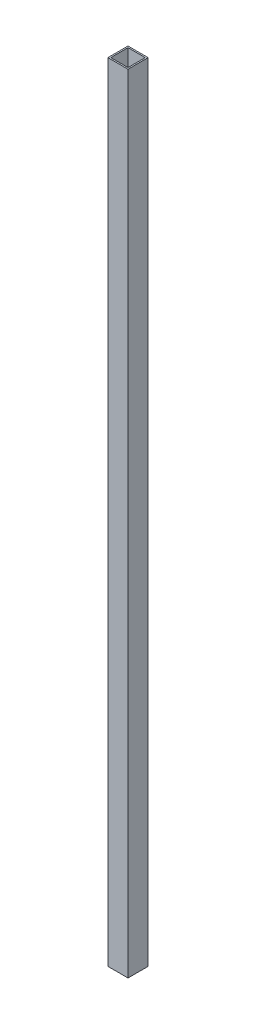
ISO-10303-21;
HEADER;
FILE_DESCRIPTION(('STEP AP214'),'2;1');
FILE_NAME('part.step','',(''),(''),'','','');
FILE_SCHEMA(('AUTOMOTIVE_DESIGN { 1 0 10303 214 1 1 1 1 }'));
ENDSEC;
DATA;
#1=APPLICATION_CONTEXT('core data for automotive mechanical design processes');
#2=APPLICATION_PROTOCOL_DEFINITION('international standard','automotive_design',2000,#1);
#3=PRODUCT_CONTEXT('',#1,'mechanical');
#4=PRODUCT('Part','Part','',(#3));
#5=PRODUCT_RELATED_PRODUCT_CATEGORY('part','',(#4));
#6=PRODUCT_DEFINITION_FORMATION('','',#4);
#7=PRODUCT_DEFINITION_CONTEXT('part definition',#1,'design');
#8=PRODUCT_DEFINITION('design','',#6,#7);
#9=PRODUCT_DEFINITION_SHAPE('','',#8);
#10=(LENGTH_UNIT() NAMED_UNIT(*) SI_UNIT(.MILLI.,.METRE.));
#11=(NAMED_UNIT(*) PLANE_ANGLE_UNIT() SI_UNIT($,.RADIAN.));
#12=(NAMED_UNIT(*) SI_UNIT($,.STERADIAN.) SOLID_ANGLE_UNIT());
#13=UNCERTAINTY_MEASURE_WITH_UNIT(LENGTH_MEASURE(1.E-05),#10,'distance_accuracy_value','');
#14=(GEOMETRIC_REPRESENTATION_CONTEXT(3) GLOBAL_UNCERTAINTY_ASSIGNED_CONTEXT((#13)) GLOBAL_UNIT_ASSIGNED_CONTEXT((#10,
#11,#12)) REPRESENTATION_CONTEXT('',''));
#15=CARTESIAN_POINT('',(0.,0.,0.));
#16=DIRECTION('',(0.,0.,1.));
#17=DIRECTION('',(1.,0.,0.));
#18=AXIS2_PLACEMENT_3D('',#15,#16,#17);
#19=CARTESIAN_POINT('',(3.175,-1739.9,-47.625));
#20=DIRECTION('',(1.,0.,0.));
#21=DIRECTION('',(0.,0.,-1.));
#22=AXIS2_PLACEMENT_3D('',#19,#20,#21);
#23=PLANE('',#22);
#24=DIRECTION('',(0.,0.,-1.));
#25=VECTOR('',#24,1.);
#26=CARTESIAN_POINT('',(3.175,-1739.9,-47.625));
#27=LINE('',#26,#25);
#28=CARTESIAN_POINT('',(3.175,-1739.9,-66.675));
#29=VERTEX_POINT('',#28);
#30=CARTESIAN_POINT('',(3.175,-1739.9,-28.575));
#31=VERTEX_POINT('',#30);
#32=EDGE_CURVE('E116',#29,#31,#27,.F.);
#33=ORIENTED_EDGE('',*,*,#32,.F.);
#34=DIRECTION('',(0.,1.,0.));
#35=VECTOR('',#34,1.);
#36=CARTESIAN_POINT('',(3.175,-1739.9,-66.675));
#37=LINE('',#36,#35);
#38=CARTESIAN_POINT('',(3.175,0.,-66.675));
#39=VERTEX_POINT('',#38);
#40=EDGE_CURVE('E95',#39,#29,#37,.F.);
#41=ORIENTED_EDGE('',*,*,#40,.F.);
#42=DIRECTION('',(0.,0.,-1.));
#43=VECTOR('',#42,1.);
#44=CARTESIAN_POINT('',(3.175,0.,-47.625));
#45=LINE('',#44,#43);
#46=CARTESIAN_POINT('',(3.175,0.,-28.575));
#47=VERTEX_POINT('',#46);
#48=EDGE_CURVE('E101',#39,#47,#45,.F.);
#49=ORIENTED_EDGE('',*,*,#48,.T.);
#50=DIRECTION('',(0.,1.,0.));
#51=VECTOR('',#50,1.);
#52=CARTESIAN_POINT('',(3.175,-1739.9,-28.575));
#53=LINE('',#52,#51);
#54=EDGE_CURVE('E17',#47,#31,#53,.F.);
#55=ORIENTED_EDGE('',*,*,#54,.T.);
#56=EDGE_LOOP('',(#33,#41,#49,#55));
#57=FACE_BOUND('',#56,.T.);
#58=ADVANCED_FACE('F14',(#57),#23,.T.);
#59=CARTESIAN_POINT('',(22.225,-1739.9,-28.575));
#60=DIRECTION('',(0.,0.,1.));
#61=DIRECTION('',(1.,0.,0.));
#62=AXIS2_PLACEMENT_3D('',#59,#60,#61);
#63=PLANE('',#62);
#64=DIRECTION('',(0.,1.,0.));
#65=VECTOR('',#64,1.);
#66=CARTESIAN_POINT('',(41.275,-1739.9,-28.575));
#67=LINE('',#66,#65);
#68=CARTESIAN_POINT('',(41.275,0.,-28.575));
#69=VERTEX_POINT('',#68);
#70=CARTESIAN_POINT('',(41.275,-1739.9,-28.575));
#71=VERTEX_POINT('',#70);
#72=EDGE_CURVE('E81',#69,#71,#67,.F.);
#73=ORIENTED_EDGE('',*,*,#72,.T.);
#74=DIRECTION('',(1.,0.,0.));
#75=VECTOR('',#74,1.);
#76=CARTESIAN_POINT('',(22.225,-1739.9,-28.575));
#77=LINE('',#76,#75);
#78=EDGE_CURVE('E122',#31,#71,#77,.T.);
#79=ORIENTED_EDGE('',*,*,#78,.F.);
#80=ORIENTED_EDGE('',*,*,#54,.F.);
#81=DIRECTION('',(1.,0.,0.));
#82=VECTOR('',#81,1.);
#83=CARTESIAN_POINT('',(22.225,0.,-28.575));
#84=LINE('',#83,#82);
#85=EDGE_CURVE('E78',#47,#69,#84,.T.);
#86=ORIENTED_EDGE('',*,*,#85,.T.);
#87=EDGE_LOOP('',(#73,#79,#80,#86));
#88=FACE_BOUND('',#87,.T.);
#89=ADVANCED_FACE('F80',(#88),#63,.F.);
#90=CARTESIAN_POINT('',(41.275,-1739.9,-47.625));
#91=DIRECTION('',(1.,0.,0.));
#92=DIRECTION('',(0.,0.,-1.));
#93=AXIS2_PLACEMENT_3D('',#90,#91,#92);
#94=PLANE('',#93);
#95=DIRECTION('',(0.,1.,0.));
#96=VECTOR('',#95,1.);
#97=CARTESIAN_POINT('',(41.275,-1739.9,-66.675));
#98=LINE('',#97,#96);
#99=CARTESIAN_POINT('',(41.275,-1739.9,-66.675));
#100=VERTEX_POINT('',#99);
#101=CARTESIAN_POINT('',(41.275,0.,-66.675));
#102=VERTEX_POINT('',#101);
#103=EDGE_CURVE('E87',#100,#102,#98,.T.);
#104=ORIENTED_EDGE('',*,*,#103,.F.);
#105=DIRECTION('',(0.,0.,-1.));
#106=VECTOR('',#105,1.);
#107=CARTESIAN_POINT('',(41.275,-1739.9,-47.625));
#108=LINE('',#107,#106);
#109=EDGE_CURVE('E93',#71,#100,#108,.T.);
#110=ORIENTED_EDGE('',*,*,#109,.F.);
#111=ORIENTED_EDGE('',*,*,#72,.F.);
#112=DIRECTION('',(0.,0.,-1.));
#113=VECTOR('',#112,1.);
#114=CARTESIAN_POINT('',(41.275,0.,-47.625));
#115=LINE('',#114,#113);
#116=EDGE_CURVE('E86',#69,#102,#115,.T.);
#117=ORIENTED_EDGE('',*,*,#116,.T.);
#118=EDGE_LOOP('',(#104,#110,#111,#117));
#119=FACE_BOUND('',#118,.T.);
#120=ADVANCED_FACE('F90',(#119),#94,.F.);
#121=CARTESIAN_POINT('',(22.225,-1739.9,-66.675));
#122=DIRECTION('',(0.,0.,1.));
#123=DIRECTION('',(1.,0.,0.));
#124=AXIS2_PLACEMENT_3D('',#121,#122,#123);
#125=PLANE('',#124);
#126=DIRECTION('',(1.,0.,0.));
#127=VECTOR('',#126,1.);
#128=CARTESIAN_POINT('',(22.225,-1739.9,-66.675));
#129=LINE('',#128,#127);
#130=EDGE_CURVE('E111',#100,#29,#129,.F.);
#131=ORIENTED_EDGE('',*,*,#130,.F.);
#132=ORIENTED_EDGE('',*,*,#103,.T.);
#133=DIRECTION('',(1.,0.,0.));
#134=VECTOR('',#133,1.);
#135=CARTESIAN_POINT('',(22.225,0.,-66.675));
#136=LINE('',#135,#134);
#137=EDGE_CURVE('E99',#102,#39,#136,.F.);
#138=ORIENTED_EDGE('',*,*,#137,.T.);
#139=ORIENTED_EDGE('',*,*,#40,.T.);
#140=EDGE_LOOP('',(#131,#132,#138,#139));
#141=FACE_BOUND('',#140,.T.);
#142=ADVANCED_FACE('F110',(#141),#125,.T.);
#143=CARTESIAN_POINT('',(22.225,-1739.9,-69.85));
#144=DIRECTION('',(0.,0.,1.));
#145=DIRECTION('',(1.,0.,0.));
#146=AXIS2_PLACEMENT_3D('',#143,#144,#145);
#147=PLANE('',#146);
#148=DIRECTION('',(0.,1.,0.));
#149=VECTOR('',#148,1.);
#150=CARTESIAN_POINT('',(44.45,-1739.9,-69.85));
#151=LINE('',#150,#149);
#152=CARTESIAN_POINT('',(44.45,-1739.9,-69.85));
#153=VERTEX_POINT('',#152);
#154=CARTESIAN_POINT('',(44.45,0.,-69.85));
#155=VERTEX_POINT('',#154);
#156=EDGE_CURVE('E232',#153,#155,#151,.T.);
#157=ORIENTED_EDGE('',*,*,#156,.F.);
#158=DIRECTION('',(1.,0.,0.));
#159=VECTOR('',#158,1.);
#160=CARTESIAN_POINT('',(22.225,-1739.9,-69.85));
#161=LINE('',#160,#159);
#162=CARTESIAN_POINT('',(0.,-1739.9,-69.85));
#163=VERTEX_POINT('',#162);
#164=EDGE_CURVE('E120',#163,#153,#161,.T.);
#165=ORIENTED_EDGE('',*,*,#164,.F.);
#166=DIRECTION('',(0.,1.,0.));
#167=VECTOR('',#166,1.);
#168=CARTESIAN_POINT('',(0.,-1739.9,-69.85));
#169=LINE('',#168,#167);
#170=CARTESIAN_POINT('',(0.,0.,-69.85));
#171=VERTEX_POINT('',#170);
#172=EDGE_CURVE('E130',#163,#171,#169,.T.);
#173=ORIENTED_EDGE('',*,*,#172,.T.);
#174=DIRECTION('',(1.,0.,0.));
#175=VECTOR('',#174,1.);
#176=CARTESIAN_POINT('',(22.225,0.,-69.85));
#177=LINE('',#176,#175);
#178=EDGE_CURVE('E132',#171,#155,#177,.T.);
#179=ORIENTED_EDGE('',*,*,#178,.T.);
#180=EDGE_LOOP('',(#157,#165,#173,#179));
#181=FACE_BOUND('',#180,.T.);
#182=ADVANCED_FACE('F158',(#181),#147,.F.);
#183=CARTESIAN_POINT('',(22.225,0.,-47.625));
#184=DIRECTION('',(0.,-1.,0.));
#185=DIRECTION('',(0.,0.,-1.));
#186=AXIS2_PLACEMENT_3D('',#183,#184,#185);
#187=PLANE('',#186);
#188=DIRECTION('',(0.,0.,-1.));
#189=VECTOR('',#188,1.);
#190=CARTESIAN_POINT('',(44.45,0.,-47.625));
#191=LINE('',#190,#189);
#192=CARTESIAN_POINT('',(44.45,0.,-25.4));
#193=VERTEX_POINT('',#192);
#194=EDGE_CURVE('E238',#155,#193,#191,.F.);
#195=ORIENTED_EDGE('',*,*,#194,.F.);
#196=ORIENTED_EDGE('',*,*,#178,.F.);
#197=DIRECTION('',(0.,0.,-1.));
#198=VECTOR('',#197,1.);
#199=CARTESIAN_POINT('',(0.,0.,-47.625));
#200=LINE('',#199,#198);
#201=CARTESIAN_POINT('',(0.,0.,-25.4));
#202=VERTEX_POINT('',#201);
#203=EDGE_CURVE('E128',#171,#202,#200,.F.);
#204=ORIENTED_EDGE('',*,*,#203,.T.);
#205=DIRECTION('',(1.,0.,0.));
#206=VECTOR('',#205,1.);
#207=CARTESIAN_POINT('',(22.225,0.,-25.4));
#208=LINE('',#207,#206);
#209=EDGE_CURVE('E236',#193,#202,#208,.F.);
#210=ORIENTED_EDGE('',*,*,#209,.F.);
#211=EDGE_LOOP('',(#195,#196,#204,#210));
#212=FACE_BOUND('',#211,.T.);
#213=ORIENTED_EDGE('',*,*,#137,.F.);
#214=ORIENTED_EDGE('',*,*,#116,.F.);
#215=ORIENTED_EDGE('',*,*,#85,.F.);
#216=ORIENTED_EDGE('',*,*,#48,.F.);
#217=EDGE_LOOP('',(#213,#214,#215,#216));
#218=FACE_BOUND('',#217,.T.);
#219=ADVANCED_FACE('F97',(#212,#218),#187,.F.);
#220=CARTESIAN_POINT('',(0.,-1739.9,-47.625));
#221=DIRECTION('',(1.,0.,0.));
#222=DIRECTION('',(0.,0.,-1.));
#223=AXIS2_PLACEMENT_3D('',#220,#221,#222);
#224=PLANE('',#223);
#225=ORIENTED_EDGE('',*,*,#172,.F.);
#226=DIRECTION('',(0.,0.,-1.));
#227=VECTOR('',#226,1.);
#228=CARTESIAN_POINT('',(0.,-1739.9,-47.625));
#229=LINE('',#228,#227);
#230=CARTESIAN_POINT('',(0.,-1739.9,-25.4));
#231=VERTEX_POINT('',#230);
#232=EDGE_CURVE('E117',#231,#163,#229,.T.);
#233=ORIENTED_EDGE('',*,*,#232,.F.);
#234=DIRECTION('',(0.,1.,0.));
#235=VECTOR('',#234,1.);
#236=CARTESIAN_POINT('',(0.,-1739.9,-25.4));
#237=LINE('',#236,#235);
#238=EDGE_CURVE('E245',#202,#231,#237,.F.);
#239=ORIENTED_EDGE('',*,*,#238,.F.);
#240=ORIENTED_EDGE('',*,*,#203,.F.);
#241=EDGE_LOOP('',(#225,#233,#239,#240));
#242=FACE_BOUND('',#241,.T.);
#243=ADVANCED_FACE('F152',(#242),#224,.F.);
#244=CARTESIAN_POINT('',(22.225,-1739.9,-47.625));
#245=DIRECTION('',(0.,-1.,0.));
#246=DIRECTION('',(0.,0.,-1.));
#247=AXIS2_PLACEMENT_3D('',#244,#245,#246);
#248=PLANE('',#247);
#249=ORIENTED_EDGE('',*,*,#164,.T.);
#250=DIRECTION('',(0.,0.,-1.));
#251=VECTOR('',#250,1.);
#252=CARTESIAN_POINT('',(44.45,-1739.9,-47.625));
#253=LINE('',#252,#251);
#254=CARTESIAN_POINT('',(44.45,-1739.9,-25.4));
#255=VERTEX_POINT('',#254);
#256=EDGE_CURVE('E32',#255,#153,#253,.T.);
#257=ORIENTED_EDGE('',*,*,#256,.F.);
#258=DIRECTION('',(1.,0.,0.));
#259=VECTOR('',#258,1.);
#260=CARTESIAN_POINT('',(22.225,-1739.9,-25.4));
#261=LINE('',#260,#259);
#262=EDGE_CURVE('E23',#231,#255,#261,.T.);
#263=ORIENTED_EDGE('',*,*,#262,.F.);
#264=ORIENTED_EDGE('',*,*,#232,.T.);
#265=EDGE_LOOP('',(#249,#257,#263,#264));
#266=FACE_BOUND('',#265,.T.);
#267=ORIENTED_EDGE('',*,*,#109,.T.);
#268=ORIENTED_EDGE('',*,*,#130,.T.);
#269=ORIENTED_EDGE('',*,*,#32,.T.);
#270=ORIENTED_EDGE('',*,*,#78,.T.);
#271=EDGE_LOOP('',(#267,#268,#269,#270));
#272=FACE_BOUND('',#271,.T.);
#273=ADVANCED_FACE('F115',(#266,#272),#248,.T.);
#274=CARTESIAN_POINT('',(44.45,-1739.9,-47.625));
#275=DIRECTION('',(1.,0.,0.));
#276=DIRECTION('',(0.,0.,-1.));
#277=AXIS2_PLACEMENT_3D('',#274,#275,#276);
#278=PLANE('',#277);
#279=ORIENTED_EDGE('',*,*,#256,.T.);
#280=ORIENTED_EDGE('',*,*,#156,.T.);
#281=ORIENTED_EDGE('',*,*,#194,.T.);
#282=DIRECTION('',(0.,1.,0.));
#283=VECTOR('',#282,1.);
#284=CARTESIAN_POINT('',(44.45,-1739.9,-25.4));
#285=LINE('',#284,#283);
#286=EDGE_CURVE('E9',#255,#193,#285,.T.);
#287=ORIENTED_EDGE('',*,*,#286,.F.);
#288=EDGE_LOOP('',(#279,#280,#281,#287));
#289=FACE_BOUND('',#288,.T.);
#290=ADVANCED_FACE('F140',(#289),#278,.T.);
#291=CARTESIAN_POINT('',(22.225,-1739.9,-25.4));
#292=DIRECTION('',(0.,0.,1.));
#293=DIRECTION('',(1.,0.,0.));
#294=AXIS2_PLACEMENT_3D('',#291,#292,#293);
#295=PLANE('',#294);
#296=ORIENTED_EDGE('',*,*,#262,.T.);
#297=ORIENTED_EDGE('',*,*,#286,.T.);
#298=ORIENTED_EDGE('',*,*,#209,.T.);
#299=ORIENTED_EDGE('',*,*,#238,.T.);
#300=EDGE_LOOP('',(#296,#297,#298,#299));
#301=FACE_BOUND('',#300,.T.);
#302=ADVANCED_FACE('F138',(#301),#295,.T.);
#303=CLOSED_SHELL('',(#58,#89,#120,#142,#182,#219,#243,#273,#290,#302));
#304=MANIFOLD_SOLID_BREP('B1',#303);
#305=ADVANCED_BREP_SHAPE_REPRESENTATION('',(#18,#304),#14);
#306=SHAPE_DEFINITION_REPRESENTATION(#9,#305);
ENDSEC;
END-ISO-10303-21;
